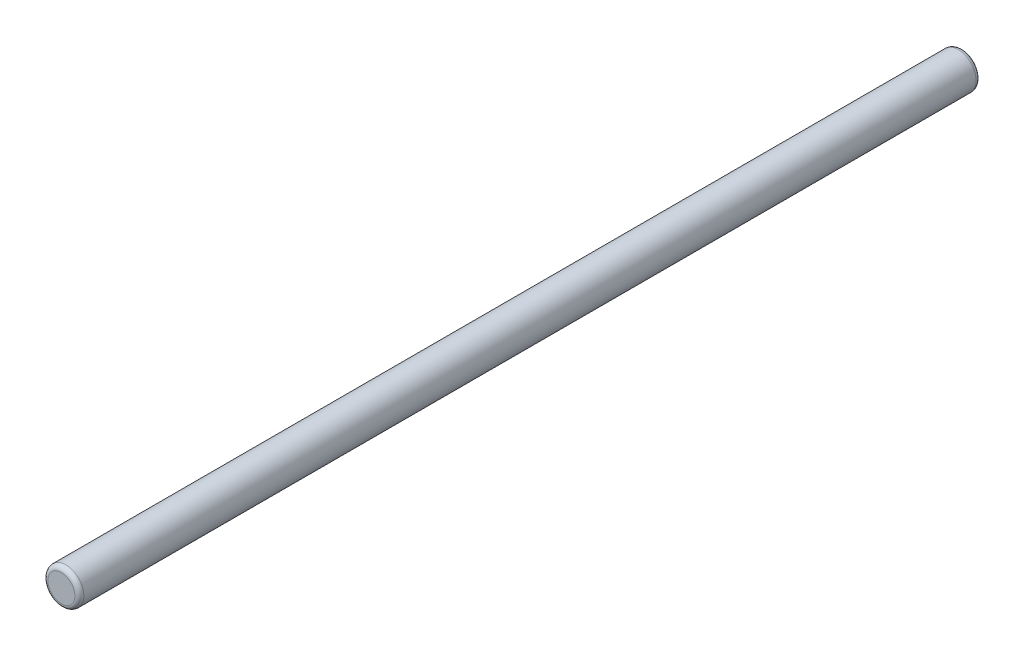
ISO-10303-21;
HEADER;
FILE_DESCRIPTION(('STEP AP214'),'2;1');
FILE_NAME('part.step','',(''),(''),'','','');
FILE_SCHEMA(('AUTOMOTIVE_DESIGN { 1 0 10303 214 1 1 1 1 }'));
ENDSEC;
DATA;
#1=APPLICATION_CONTEXT('core data for automotive mechanical design processes');
#2=APPLICATION_PROTOCOL_DEFINITION('international standard','automotive_design',2000,#1);
#3=PRODUCT_CONTEXT('',#1,'mechanical');
#4=PRODUCT('Part','Part','',(#3));
#5=PRODUCT_RELATED_PRODUCT_CATEGORY('part','',(#4));
#6=PRODUCT_DEFINITION_FORMATION('','',#4);
#7=PRODUCT_DEFINITION_CONTEXT('part definition',#1,'design');
#8=PRODUCT_DEFINITION('design','',#6,#7);
#9=PRODUCT_DEFINITION_SHAPE('','',#8);
#10=(LENGTH_UNIT() NAMED_UNIT(*) SI_UNIT(.MILLI.,.METRE.));
#11=(NAMED_UNIT(*) PLANE_ANGLE_UNIT() SI_UNIT($,.RADIAN.));
#12=(NAMED_UNIT(*) SI_UNIT($,.STERADIAN.) SOLID_ANGLE_UNIT());
#13=UNCERTAINTY_MEASURE_WITH_UNIT(LENGTH_MEASURE(1.E-05),#10,'distance_accuracy_value','');
#14=(GEOMETRIC_REPRESENTATION_CONTEXT(3) GLOBAL_UNCERTAINTY_ASSIGNED_CONTEXT((#13)) GLOBAL_UNIT_ASSIGNED_CONTEXT((#10,
#11,#12)) REPRESENTATION_CONTEXT('',''));
#15=CARTESIAN_POINT('',(0.,0.,0.));
#16=DIRECTION('',(0.,0.,1.));
#17=DIRECTION('',(1.,0.,0.));
#18=AXIS2_PLACEMENT_3D('',#15,#16,#17);
#19=CARTESIAN_POINT('',(0.,0.,200.));
#20=DIRECTION('',(0.,0.,-1.));
#21=DIRECTION('',(-1.,0.,0.));
#22=AXIS2_PLACEMENT_3D('',#19,#20,#21);
#23=CYLINDRICAL_SURFACE('',#22,4.);
#24=CARTESIAN_POINT('',(0.,0.,199.));
#25=DIRECTION('',(0.,0.,1.));
#26=DIRECTION('',(1.,0.,0.));
#27=AXIS2_PLACEMENT_3D('',#24,#25,#26);
#28=CIRCLE('',#27,4.);
#29=CARTESIAN_POINT('',(4.,0.,199.));
#30=VERTEX_POINT('',#29);
#31=EDGE_CURVE('E38',#30,#30,#28,.F.);
#32=ORIENTED_EDGE('',*,*,#31,.T.);
#33=EDGE_LOOP('',(#32));
#34=FACE_BOUND('',#33,.T.);
#35=CARTESIAN_POINT('',(0.,0.,1.));
#36=DIRECTION('',(0.,0.,1.));
#37=DIRECTION('',(1.,0.,0.));
#38=AXIS2_PLACEMENT_3D('',#35,#36,#37);
#39=CIRCLE('',#38,4.);
#40=CARTESIAN_POINT('',(4.,0.,1.));
#41=VERTEX_POINT('',#40);
#42=EDGE_CURVE('E42',#41,#41,#39,.T.);
#43=ORIENTED_EDGE('',*,*,#42,.T.);
#44=EDGE_LOOP('',(#43));
#45=FACE_BOUND('',#44,.T.);
#46=ADVANCED_FACE('F31',(#34,#45),#23,.T.);
#47=CARTESIAN_POINT('',(0.,0.,200.));
#48=DIRECTION('',(0.,0.,1.));
#49=DIRECTION('',(1.,0.,0.));
#50=AXIS2_PLACEMENT_3D('',#47,#48,#49);
#51=PLANE('',#50);
#52=CARTESIAN_POINT('',(0.,0.,200.));
#53=DIRECTION('',(0.,0.,1.));
#54=DIRECTION('',(1.,0.,0.));
#55=AXIS2_PLACEMENT_3D('',#52,#53,#54);
#56=CIRCLE('',#55,3.);
#57=CARTESIAN_POINT('',(3.,0.,200.));
#58=VERTEX_POINT('',#57);
#59=EDGE_CURVE('E46',#58,#58,#56,.T.);
#60=ORIENTED_EDGE('',*,*,#59,.T.);
#61=EDGE_LOOP('',(#60));
#62=FACE_BOUND('',#61,.T.);
#63=ADVANCED_FACE('F52',(#62),#51,.T.);
#64=CARTESIAN_POINT('',(0.,0.,0.));
#65=DIRECTION('',(0.,0.,1.));
#66=DIRECTION('',(1.,0.,0.));
#67=AXIS2_PLACEMENT_3D('',#64,#65,#66);
#68=PLANE('',#67);
#69=CARTESIAN_POINT('',(0.,0.,0.));
#70=DIRECTION('',(0.,0.,1.));
#71=DIRECTION('',(1.,0.,0.));
#72=AXIS2_PLACEMENT_3D('',#69,#70,#71);
#73=CIRCLE('',#72,3.);
#74=CARTESIAN_POINT('',(3.,0.,0.));
#75=VERTEX_POINT('',#74);
#76=EDGE_CURVE('E10',#75,#75,#73,.F.);
#77=ORIENTED_EDGE('',*,*,#76,.T.);
#78=EDGE_LOOP('',(#77));
#79=FACE_BOUND('',#78,.T.);
#80=ADVANCED_FACE('F56',(#79),#68,.F.);
#81=CARTESIAN_POINT('',(0.,0.,199.));
#82=DIRECTION('',(0.,0.,1.));
#83=DIRECTION('',(1.,0.,0.));
#84=AXIS2_PLACEMENT_3D('',#81,#82,#83);
#85=TOROIDAL_SURFACE('',#84,3.,1.);
#86=ORIENTED_EDGE('',*,*,#31,.F.);
#87=EDGE_LOOP('',(#86));
#88=FACE_BOUND('',#87,.T.);
#89=ORIENTED_EDGE('',*,*,#59,.F.);
#90=EDGE_LOOP('',(#89));
#91=FACE_BOUND('',#90,.T.);
#92=ADVANCED_FACE('F54',(#88,#91),#85,.T.);
#93=CARTESIAN_POINT('',(0.,0.,1.));
#94=DIRECTION('',(0.,0.,1.));
#95=DIRECTION('',(1.,0.,0.));
#96=AXIS2_PLACEMENT_3D('',#93,#94,#95);
#97=TOROIDAL_SURFACE('',#96,3.,1.);
#98=ORIENTED_EDGE('',*,*,#76,.F.);
#99=EDGE_LOOP('',(#98));
#100=FACE_BOUND('',#99,.T.);
#101=ORIENTED_EDGE('',*,*,#42,.F.);
#102=EDGE_LOOP('',(#101));
#103=FACE_BOUND('',#102,.T.);
#104=ADVANCED_FACE('F33',(#100,#103),#97,.T.);
#105=CLOSED_SHELL('',(#46,#63,#80,#92,#104));
#106=MANIFOLD_SOLID_BREP('B2',#105);
#107=ADVANCED_BREP_SHAPE_REPRESENTATION('',(#18,#106),#14);
#108=SHAPE_DEFINITION_REPRESENTATION(#9,#107);
ENDSEC;
END-ISO-10303-21;
